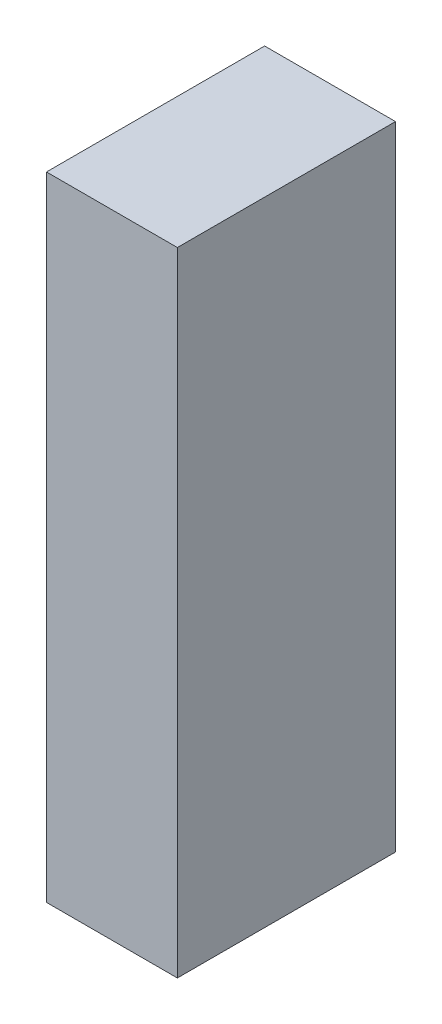
ISO-10303-21;
HEADER;
FILE_DESCRIPTION(('STEP AP214'),'2;1');
FILE_NAME('part.step','',(''),(''),'','','');
FILE_SCHEMA(('AUTOMOTIVE_DESIGN { 1 0 10303 214 1 1 1 1 }'));
ENDSEC;
DATA;
#1=APPLICATION_CONTEXT('core data for automotive mechanical design processes');
#2=APPLICATION_PROTOCOL_DEFINITION('international standard','automotive_design',2000,#1);
#3=PRODUCT_CONTEXT('',#1,'mechanical');
#4=PRODUCT('Part','Part','',(#3));
#5=PRODUCT_RELATED_PRODUCT_CATEGORY('part','',(#4));
#6=PRODUCT_DEFINITION_FORMATION('','',#4);
#7=PRODUCT_DEFINITION_CONTEXT('part definition',#1,'design');
#8=PRODUCT_DEFINITION('design','',#6,#7);
#9=PRODUCT_DEFINITION_SHAPE('','',#8);
#10=(LENGTH_UNIT() NAMED_UNIT(*) SI_UNIT(.MILLI.,.METRE.));
#11=(NAMED_UNIT(*) PLANE_ANGLE_UNIT() SI_UNIT($,.RADIAN.));
#12=(NAMED_UNIT(*) SI_UNIT($,.STERADIAN.) SOLID_ANGLE_UNIT());
#13=UNCERTAINTY_MEASURE_WITH_UNIT(LENGTH_MEASURE(1.E-05),#10,'distance_accuracy_value','');
#14=(GEOMETRIC_REPRESENTATION_CONTEXT(3) GLOBAL_UNCERTAINTY_ASSIGNED_CONTEXT((#13)) GLOBAL_UNIT_ASSIGNED_CONTEXT((#10,
#11,#12)) REPRESENTATION_CONTEXT('',''));
#15=CARTESIAN_POINT('',(0.,0.,0.));
#16=DIRECTION('',(0.,0.,1.));
#17=DIRECTION('',(1.,0.,0.));
#18=AXIS2_PLACEMENT_3D('',#15,#16,#17);
#19=CARTESIAN_POINT('',(-1.10000125022268,-0.724997035159831,-2.64111989736557));
#20=DIRECTION('',(-8.74227765734759E-08,-1.,0.));
#21=DIRECTION('',(1.,-8.74227765734759E-08,0.));
#22=AXIS2_PLACEMENT_3D('',#19,#20,#21);
#23=PLANE('',#22);
#24=DIRECTION('',(0.999999999999996,-8.74227764036189E-08,0.));
#25=VECTOR('',#24,1.);
#26=CARTESIAN_POINT('',(-1.10000125022268,-0.724997035159831,-2.64111989736557));
#27=LINE('',#26,#25);
#28=CARTESIAN_POINT('',(-1.10000125022268,-0.724997035159831,-2.64111989736557));
#29=VERTEX_POINT('',#28);
#30=CARTESIAN_POINT('',(-0.799998198464863,-0.724997061386929,-2.64111989736557));
#31=VERTEX_POINT('',#30);
#32=EDGE_CURVE('E11',#29,#31,#27,.T.);
#33=ORIENTED_EDGE('',*,*,#32,.T.);
#34=DIRECTION('',(0.,0.,1.));
#35=VECTOR('',#34,1.);
#36=CARTESIAN_POINT('',(-0.799998198464863,-0.72499706138693,-2.64111989736557));
#37=LINE('',#36,#35);
#38=CARTESIAN_POINT('',(-0.799998198464863,-0.724997061386929,-2.14112091064453));
#39=VERTEX_POINT('',#38);
#40=EDGE_CURVE('E88',#31,#39,#37,.T.);
#41=ORIENTED_EDGE('',*,*,#40,.T.);
#42=DIRECTION('',(0.999999999999996,-8.74227764036189E-08,0.));
#43=VECTOR('',#42,1.);
#44=CARTESIAN_POINT('',(-1.10000125022268,-0.724997035159831,-2.14112091064453));
#45=LINE('',#44,#43);
#46=CARTESIAN_POINT('',(-1.10000125022268,-0.724997035159831,-2.14112091064453));
#47=VERTEX_POINT('',#46);
#48=EDGE_CURVE('E83',#47,#39,#45,.T.);
#49=ORIENTED_EDGE('',*,*,#48,.F.);
#50=DIRECTION('',(0.,0.,1.));
#51=VECTOR('',#50,1.);
#52=CARTESIAN_POINT('',(-1.10000125022269,-0.724997035159831,-2.64111989736557));
#53=LINE('',#52,#51);
#54=EDGE_CURVE('E72',#29,#47,#53,.T.);
#55=ORIENTED_EDGE('',*,*,#54,.F.);
#56=EDGE_LOOP('',(#33,#41,#49,#55));
#57=FACE_BOUND('',#56,.T.);
#58=ADVANCED_FACE('F17',(#57),#23,.T.);
#59=CARTESIAN_POINT('',(-0.799998198464863,-0.724997061386929,-2.64111989736557));
#60=DIRECTION('',(1.,-8.74227765734759E-08,0.));
#61=DIRECTION('',(8.74227765734759E-08,1.,0.));
#62=AXIS2_PLACEMENT_3D('',#59,#60,#61);
#63=PLANE('',#62);
#64=DIRECTION('',(8.74227765590445E-08,0.999999999999996,0.));
#65=VECTOR('',#64,1.);
#66=CARTESIAN_POINT('',(-0.799998198464863,-0.724997061386929,-2.64111989736557));
#67=LINE('',#66,#65);
#68=CARTESIAN_POINT('',(-0.799998071701452,0.725007516249789,-2.64111989736557));
#69=VERTEX_POINT('',#68);
#70=EDGE_CURVE('E24',#31,#69,#67,.T.);
#71=ORIENTED_EDGE('',*,*,#70,.T.);
#72=DIRECTION('',(0.,0.,1.));
#73=VECTOR('',#72,1.);
#74=CARTESIAN_POINT('',(-0.799998071701437,0.725007516249789,-2.64111989736557));
#75=LINE('',#74,#73);
#76=CARTESIAN_POINT('',(-0.799998071701452,0.725007516249789,-2.14112091064453));
#77=VERTEX_POINT('',#76);
#78=EDGE_CURVE('E85',#69,#77,#75,.T.);
#79=ORIENTED_EDGE('',*,*,#78,.T.);
#80=DIRECTION('',(8.74227765590445E-08,0.999999999999996,0.));
#81=VECTOR('',#80,1.);
#82=CARTESIAN_POINT('',(-0.799998198464863,-0.724997061386929,-2.14112091064453));
#83=LINE('',#82,#81);
#84=EDGE_CURVE('E66',#39,#77,#83,.T.);
#85=ORIENTED_EDGE('',*,*,#84,.F.);
#86=ORIENTED_EDGE('',*,*,#40,.F.);
#87=EDGE_LOOP('',(#71,#79,#85,#86));
#88=FACE_BOUND('',#87,.T.);
#89=ADVANCED_FACE('F89',(#88),#63,.T.);
#90=CARTESIAN_POINT('',(-0.799998071701452,0.725007516249789,-2.64111989736557));
#91=DIRECTION('',(8.74227765734759E-08,1.,0.));
#92=DIRECTION('',(-1.,8.74227765734759E-08,0.));
#93=AXIS2_PLACEMENT_3D('',#90,#91,#92);
#94=PLANE('',#93);
#95=DIRECTION('',(-0.999999999999996,8.74227764036189E-08,0.));
#96=VECTOR('',#95,1.);
#97=CARTESIAN_POINT('',(-0.799998071701452,0.725007516249789,-2.64111989736557));
#98=LINE('',#97,#96);
#99=CARTESIAN_POINT('',(-1.10000112345926,0.725007542476888,-2.64111989736557));
#100=VERTEX_POINT('',#99);
#101=EDGE_CURVE('E62',#69,#100,#98,.T.);
#102=ORIENTED_EDGE('',*,*,#101,.T.);
#103=DIRECTION('',(0.,0.,1.));
#104=VECTOR('',#103,1.);
#105=CARTESIAN_POINT('',(-1.10000112345926,0.725007542476889,-2.64111989736557));
#106=LINE('',#105,#104);
#107=CARTESIAN_POINT('',(-1.10000112345926,0.725007542476888,-2.14112091064453));
#108=VERTEX_POINT('',#107);
#109=EDGE_CURVE('E55',#100,#108,#106,.T.);
#110=ORIENTED_EDGE('',*,*,#109,.T.);
#111=DIRECTION('',(-0.999999999999996,8.74227764036189E-08,0.));
#112=VECTOR('',#111,1.);
#113=CARTESIAN_POINT('',(-0.799998071701452,0.725007516249789,-2.14112091064453));
#114=LINE('',#113,#112);
#115=EDGE_CURVE('E59',#77,#108,#114,.T.);
#116=ORIENTED_EDGE('',*,*,#115,.F.);
#117=ORIENTED_EDGE('',*,*,#78,.F.);
#118=EDGE_LOOP('',(#102,#110,#116,#117));
#119=FACE_BOUND('',#118,.T.);
#120=ADVANCED_FACE('F57',(#119),#94,.T.);
#121=CARTESIAN_POINT('',(-1.10000112345926,0.725007542476888,-2.64111989736557));
#122=DIRECTION('',(-1.,8.74227765734759E-08,0.));
#123=DIRECTION('',(-8.74227765734759E-08,-1.,0.));
#124=AXIS2_PLACEMENT_3D('',#121,#122,#123);
#125=PLANE('',#124);
#126=DIRECTION('',(-8.74227765590445E-08,-0.999999999999996,0.));
#127=VECTOR('',#126,1.);
#128=CARTESIAN_POINT('',(-1.10000112345926,0.725007542476888,-2.64111989736557));
#129=LINE('',#128,#127);
#130=EDGE_CURVE('E65',#100,#29,#129,.T.);
#131=ORIENTED_EDGE('',*,*,#130,.T.);
#132=ORIENTED_EDGE('',*,*,#54,.T.);
#133=DIRECTION('',(-8.74227765590445E-08,-0.999999999999996,0.));
#134=VECTOR('',#133,1.);
#135=CARTESIAN_POINT('',(-1.10000112345926,0.725007542476888,-2.14112091064453));
#136=LINE('',#135,#134);
#137=EDGE_CURVE('E70',#108,#47,#136,.T.);
#138=ORIENTED_EDGE('',*,*,#137,.F.);
#139=ORIENTED_EDGE('',*,*,#109,.F.);
#140=EDGE_LOOP('',(#131,#132,#138,#139));
#141=FACE_BOUND('',#140,.T.);
#142=ADVANCED_FACE('F71',(#141),#125,.T.);
#143=CARTESIAN_POINT('',(189.900009155273,118.299987792969,-2.14112091064453));
#144=DIRECTION('',(0.,0.,1.));
#145=DIRECTION('',(-1.,8.74227765734759E-08,0.));
#146=AXIS2_PLACEMENT_3D('',#143,#144,#145);
#147=PLANE('',#146);
#148=ORIENTED_EDGE('',*,*,#48,.T.);
#149=ORIENTED_EDGE('',*,*,#84,.T.);
#150=ORIENTED_EDGE('',*,*,#115,.T.);
#151=ORIENTED_EDGE('',*,*,#137,.T.);
#152=EDGE_LOOP('',(#148,#149,#150,#151));
#153=FACE_BOUND('',#152,.T.);
#154=ADVANCED_FACE('F76',(#153),#147,.T.);
#155=CARTESIAN_POINT('',(189.900009155273,118.299987792969,-2.64111989736557));
#156=DIRECTION('',(0.,0.,1.));
#157=DIRECTION('',(-1.,8.74227765734759E-08,0.));
#158=AXIS2_PLACEMENT_3D('',#155,#156,#157);
#159=PLANE('',#158);
#160=ORIENTED_EDGE('',*,*,#130,.F.);
#161=ORIENTED_EDGE('',*,*,#101,.F.);
#162=ORIENTED_EDGE('',*,*,#70,.F.);
#163=ORIENTED_EDGE('',*,*,#32,.F.);
#164=EDGE_LOOP('',(#160,#161,#162,#163));
#165=FACE_BOUND('',#164,.T.);
#166=ADVANCED_FACE('F91',(#165),#159,.F.);
#167=CLOSED_SHELL('',(#58,#89,#120,#142,#154,#166));
#168=MANIFOLD_SOLID_BREP('B1',#167);
#169=ADVANCED_BREP_SHAPE_REPRESENTATION('',(#18,#168),#14);
#170=SHAPE_DEFINITION_REPRESENTATION(#9,#169);
ENDSEC;
END-ISO-10303-21;
